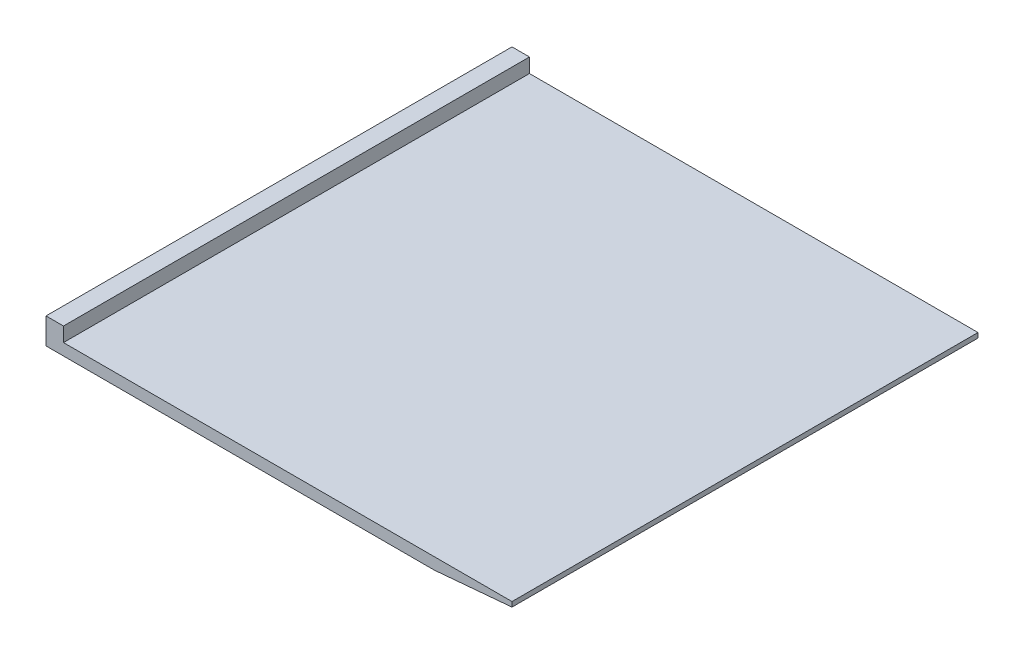
ISO-10303-21;
HEADER;
FILE_DESCRIPTION(('STEP AP214'),'2;1');
FILE_NAME('part.step','',(''),(''),'','','');
FILE_SCHEMA(('AUTOMOTIVE_DESIGN { 1 0 10303 214 1 1 1 1 }'));
ENDSEC;
DATA;
#1=APPLICATION_CONTEXT('core data for automotive mechanical design processes');
#2=APPLICATION_PROTOCOL_DEFINITION('international standard','automotive_design',2000,#1);
#3=PRODUCT_CONTEXT('',#1,'mechanical');
#4=PRODUCT('Part','Part','',(#3));
#5=PRODUCT_RELATED_PRODUCT_CATEGORY('part','',(#4));
#6=PRODUCT_DEFINITION_FORMATION('','',#4);
#7=PRODUCT_DEFINITION_CONTEXT('part definition',#1,'design');
#8=PRODUCT_DEFINITION('design','',#6,#7);
#9=PRODUCT_DEFINITION_SHAPE('','',#8);
#10=(LENGTH_UNIT() NAMED_UNIT(*) SI_UNIT(.MILLI.,.METRE.));
#11=(NAMED_UNIT(*) PLANE_ANGLE_UNIT() SI_UNIT($,.RADIAN.));
#12=(NAMED_UNIT(*) SI_UNIT($,.STERADIAN.) SOLID_ANGLE_UNIT());
#13=UNCERTAINTY_MEASURE_WITH_UNIT(LENGTH_MEASURE(1.E-05),#10,'distance_accuracy_value','');
#14=(GEOMETRIC_REPRESENTATION_CONTEXT(3) GLOBAL_UNCERTAINTY_ASSIGNED_CONTEXT((#13)) GLOBAL_UNIT_ASSIGNED_CONTEXT((#10,
#11,#12)) REPRESENTATION_CONTEXT('',''));
#15=CARTESIAN_POINT('',(0.,0.,0.));
#16=DIRECTION('',(0.,0.,1.));
#17=DIRECTION('',(1.,0.,0.));
#18=AXIS2_PLACEMENT_3D('',#15,#16,#17);
#19=CARTESIAN_POINT('',(0.,1.5,0.));
#20=DIRECTION('',(0.,-1.,0.));
#21=DIRECTION('',(0.,0.,-1.));
#22=AXIS2_PLACEMENT_3D('',#19,#20,#21);
#23=PLANE('',#22);
#24=DIRECTION('',(0.,0.,-1.));
#25=VECTOR('',#24,1.);
#26=CARTESIAN_POINT('',(-27.75,1.5,-30.));
#27=LINE('',#26,#25);
#28=CARTESIAN_POINT('',(-27.75,1.5,30.));
#29=VERTEX_POINT('',#28);
#30=CARTESIAN_POINT('',(-27.75,1.5,-30.));
#31=VERTEX_POINT('',#30);
#32=EDGE_CURVE('E133',#29,#31,#27,.T.);
#33=ORIENTED_EDGE('',*,*,#32,.F.);
#34=DIRECTION('',(1.,0.,0.));
#35=VECTOR('',#34,1.);
#36=CARTESIAN_POINT('',(-30.,1.5,30.));
#37=LINE('',#36,#35);
#38=CARTESIAN_POINT('',(30.,1.5,30.));
#39=VERTEX_POINT('',#38);
#40=EDGE_CURVE('E158',#29,#39,#37,.T.);
#41=ORIENTED_EDGE('',*,*,#40,.T.);
#42=DIRECTION('',(0.,0.,-1.));
#43=VECTOR('',#42,1.);
#44=CARTESIAN_POINT('',(30.,1.5,30.));
#45=LINE('',#44,#43);
#46=CARTESIAN_POINT('',(30.,1.5,-30.));
#47=VERTEX_POINT('',#46);
#48=EDGE_CURVE('E150',#39,#47,#45,.T.);
#49=ORIENTED_EDGE('',*,*,#48,.T.);
#50=DIRECTION('',(-1.,0.,0.));
#51=VECTOR('',#50,1.);
#52=CARTESIAN_POINT('',(-30.,1.5,-30.));
#53=LINE('',#52,#51);
#54=EDGE_CURVE('E154',#47,#31,#53,.T.);
#55=ORIENTED_EDGE('',*,*,#54,.T.);
#56=EDGE_LOOP('',(#33,#41,#49,#55));
#57=FACE_BOUND('',#56,.T.);
#58=ADVANCED_FACE('F44',(#57),#23,.F.);
#59=CARTESIAN_POINT('',(30.,1.5,30.));
#60=DIRECTION('',(-1.,0.,0.));
#61=DIRECTION('',(0.,0.,1.));
#62=AXIS2_PLACEMENT_3D('',#59,#60,#61);
#63=PLANE('',#62);
#64=DIRECTION('',(0.,-1.,0.));
#65=VECTOR('',#64,1.);
#66=CARTESIAN_POINT('',(30.,1.5,30.));
#67=LINE('',#66,#65);
#68=CARTESIAN_POINT('',(30.,0.874886635259243,30.));
#69=VERTEX_POINT('',#68);
#70=EDGE_CURVE('E115',#39,#69,#67,.T.);
#71=ORIENTED_EDGE('',*,*,#70,.T.);
#72=DIRECTION('',(0.,0.,-1.));
#73=VECTOR('',#72,1.);
#74=CARTESIAN_POINT('',(30.,0.874886635259243,-30.));
#75=LINE('',#74,#73);
#76=CARTESIAN_POINT('',(30.,0.874886635259243,-30.));
#77=VERTEX_POINT('',#76);
#78=EDGE_CURVE('E175',#69,#77,#75,.T.);
#79=ORIENTED_EDGE('',*,*,#78,.T.);
#80=DIRECTION('',(0.,-1.,0.));
#81=VECTOR('',#80,1.);
#82=CARTESIAN_POINT('',(30.,1.5,-30.));
#83=LINE('',#82,#81);
#84=EDGE_CURVE('E172',#47,#77,#83,.T.);
#85=ORIENTED_EDGE('',*,*,#84,.F.);
#86=ORIENTED_EDGE('',*,*,#48,.F.);
#87=EDGE_LOOP('',(#71,#79,#85,#86));
#88=FACE_BOUND('',#87,.T.);
#89=ADVANCED_FACE('F184',(#88),#63,.F.);
#90=CARTESIAN_POINT('',(-30.,1.5,-30.));
#91=DIRECTION('',(0.,0.,1.));
#92=DIRECTION('',(1.,0.,0.));
#93=AXIS2_PLACEMENT_3D('',#90,#91,#92);
#94=PLANE('',#93);
#95=ORIENTED_EDGE('',*,*,#84,.T.);
#96=DIRECTION('',(-0.996194698091746,-0.0871557427476549,0.));
#97=VECTOR('',#96,1.);
#98=CARTESIAN_POINT('',(30.,0.874886635259243,-30.));
#99=LINE('',#98,#97);
#100=CARTESIAN_POINT('',(19.9999999999996,0.,-30.));
#101=VERTEX_POINT('',#100);
#102=EDGE_CURVE('E68',#77,#101,#99,.T.);
#103=ORIENTED_EDGE('',*,*,#102,.T.);
#104=DIRECTION('',(-1.,0.,0.));
#105=VECTOR('',#104,1.);
#106=CARTESIAN_POINT('',(-30.,0.,-30.));
#107=LINE('',#106,#105);
#108=CARTESIAN_POINT('',(-30.,0.,-30.));
#109=VERTEX_POINT('',#108);
#110=EDGE_CURVE('E149',#101,#109,#107,.T.);
#111=ORIENTED_EDGE('',*,*,#110,.T.);
#112=DIRECTION('',(0.,-1.,0.));
#113=VECTOR('',#112,1.);
#114=CARTESIAN_POINT('',(-30.,1.5,-30.));
#115=LINE('',#114,#113);
#116=CARTESIAN_POINT('',(-30.,3.35,-30.));
#117=VERTEX_POINT('',#116);
#118=EDGE_CURVE('E114',#117,#109,#115,.T.);
#119=ORIENTED_EDGE('',*,*,#118,.F.);
#120=DIRECTION('',(-1.,0.,0.));
#121=VECTOR('',#120,1.);
#122=CARTESIAN_POINT('',(-30.,3.35,-30.));
#123=LINE('',#122,#121);
#124=CARTESIAN_POINT('',(-27.75,3.35,-30.));
#125=VERTEX_POINT('',#124);
#126=EDGE_CURVE('E131',#125,#117,#123,.T.);
#127=ORIENTED_EDGE('',*,*,#126,.F.);
#128=DIRECTION('',(0.,-1.,0.));
#129=VECTOR('',#128,1.);
#130=CARTESIAN_POINT('',(-27.75,3.35,-30.));
#131=LINE('',#130,#129);
#132=EDGE_CURVE('E142',#125,#31,#131,.T.);
#133=ORIENTED_EDGE('',*,*,#132,.T.);
#134=ORIENTED_EDGE('',*,*,#54,.F.);
#135=EDGE_LOOP('',(#95,#103,#111,#119,#127,#133,#134));
#136=FACE_BOUND('',#135,.T.);
#137=ADVANCED_FACE('F189',(#136),#94,.F.);
#138=CARTESIAN_POINT('',(-30.,1.5,30.));
#139=DIRECTION('',(1.,0.,0.));
#140=DIRECTION('',(0.,0.,-1.));
#141=AXIS2_PLACEMENT_3D('',#138,#139,#140);
#142=PLANE('',#141);
#143=DIRECTION('',(0.,0.,1.));
#144=VECTOR('',#143,1.);
#145=CARTESIAN_POINT('',(-30.,0.,30.));
#146=LINE('',#145,#144);
#147=CARTESIAN_POINT('',(-30.,0.,30.));
#148=VERTEX_POINT('',#147);
#149=EDGE_CURVE('E111',#109,#148,#146,.T.);
#150=ORIENTED_EDGE('',*,*,#149,.T.);
#151=DIRECTION('',(0.,-1.,0.));
#152=VECTOR('',#151,1.);
#153=CARTESIAN_POINT('',(-30.,1.5,30.));
#154=LINE('',#153,#152);
#155=CARTESIAN_POINT('',(-30.,3.35,30.));
#156=VERTEX_POINT('',#155);
#157=EDGE_CURVE('E104',#156,#148,#154,.T.);
#158=ORIENTED_EDGE('',*,*,#157,.F.);
#159=DIRECTION('',(0.,0.,1.));
#160=VECTOR('',#159,1.);
#161=CARTESIAN_POINT('',(-30.,3.35,-30.));
#162=LINE('',#161,#160);
#163=EDGE_CURVE('E109',#117,#156,#162,.T.);
#164=ORIENTED_EDGE('',*,*,#163,.F.);
#165=ORIENTED_EDGE('',*,*,#118,.T.);
#166=EDGE_LOOP('',(#150,#158,#164,#165));
#167=FACE_BOUND('',#166,.T.);
#168=ADVANCED_FACE('F106',(#167),#142,.F.);
#169=CARTESIAN_POINT('',(-30.,1.5,30.));
#170=DIRECTION('',(0.,0.,-1.));
#171=DIRECTION('',(-1.,0.,0.));
#172=AXIS2_PLACEMENT_3D('',#169,#170,#171);
#173=PLANE('',#172);
#174=DIRECTION('',(1.,0.,0.));
#175=VECTOR('',#174,1.);
#176=CARTESIAN_POINT('',(-30.,0.,30.));
#177=LINE('',#176,#175);
#178=CARTESIAN_POINT('',(19.9999999999996,0.,30.));
#179=VERTEX_POINT('',#178);
#180=EDGE_CURVE('E155',#148,#179,#177,.T.);
#181=ORIENTED_EDGE('',*,*,#180,.T.);
#182=DIRECTION('',(0.996194698091746,0.0871557427476549,0.));
#183=VECTOR('',#182,1.);
#184=CARTESIAN_POINT('',(30.,0.874886635259243,30.));
#185=LINE('',#184,#183);
#186=EDGE_CURVE('E11',#179,#69,#185,.T.);
#187=ORIENTED_EDGE('',*,*,#186,.T.);
#188=ORIENTED_EDGE('',*,*,#70,.F.);
#189=ORIENTED_EDGE('',*,*,#40,.F.);
#190=DIRECTION('',(0.,-1.,0.));
#191=VECTOR('',#190,1.);
#192=CARTESIAN_POINT('',(-27.75,3.35,30.));
#193=LINE('',#192,#191);
#194=CARTESIAN_POINT('',(-27.75,3.35,30.));
#195=VERTEX_POINT('',#194);
#196=EDGE_CURVE('E122',#195,#29,#193,.T.);
#197=ORIENTED_EDGE('',*,*,#196,.F.);
#198=DIRECTION('',(1.,0.,0.));
#199=VECTOR('',#198,1.);
#200=CARTESIAN_POINT('',(-30.,3.35,30.));
#201=LINE('',#200,#199);
#202=EDGE_CURVE('E118',#156,#195,#201,.T.);
#203=ORIENTED_EDGE('',*,*,#202,.F.);
#204=ORIENTED_EDGE('',*,*,#157,.T.);
#205=EDGE_LOOP('',(#181,#187,#188,#189,#197,#203,#204));
#206=FACE_BOUND('',#205,.T.);
#207=ADVANCED_FACE('F119',(#206),#173,.F.);
#208=CARTESIAN_POINT('',(0.,0.,0.));
#209=DIRECTION('',(0.,-1.,0.));
#210=DIRECTION('',(0.,0.,-1.));
#211=AXIS2_PLACEMENT_3D('',#208,#209,#210);
#212=PLANE('',#211);
#213=ORIENTED_EDGE('',*,*,#110,.F.);
#214=DIRECTION('',(0.,0.,1.));
#215=VECTOR('',#214,1.);
#216=CARTESIAN_POINT('',(19.9999999999996,0.,30.));
#217=LINE('',#216,#215);
#218=EDGE_CURVE('E54',#101,#179,#217,.T.);
#219=ORIENTED_EDGE('',*,*,#218,.T.);
#220=ORIENTED_EDGE('',*,*,#180,.F.);
#221=ORIENTED_EDGE('',*,*,#149,.F.);
#222=EDGE_LOOP('',(#213,#219,#220,#221));
#223=FACE_BOUND('',#222,.T.);
#224=ADVANCED_FACE('F206',(#223),#212,.T.);
#225=CARTESIAN_POINT('',(-27.75,3.35,-30.));
#226=DIRECTION('',(-1.,0.,0.));
#227=DIRECTION('',(0.,0.,1.));
#228=AXIS2_PLACEMENT_3D('',#225,#226,#227);
#229=PLANE('',#228);
#230=ORIENTED_EDGE('',*,*,#32,.T.);
#231=ORIENTED_EDGE('',*,*,#132,.F.);
#232=DIRECTION('',(0.,0.,-1.));
#233=VECTOR('',#232,1.);
#234=CARTESIAN_POINT('',(-27.75,3.35,-30.));
#235=LINE('',#234,#233);
#236=EDGE_CURVE('E126',#195,#125,#235,.T.);
#237=ORIENTED_EDGE('',*,*,#236,.F.);
#238=ORIENTED_EDGE('',*,*,#196,.T.);
#239=EDGE_LOOP('',(#230,#231,#237,#238));
#240=FACE_BOUND('',#239,.T.);
#241=ADVANCED_FACE('F196',(#240),#229,.F.);
#242=CARTESIAN_POINT('',(0.,3.35,0.));
#243=DIRECTION('',(0.,1.,0.));
#244=DIRECTION('',(0.,0.,1.));
#245=AXIS2_PLACEMENT_3D('',#242,#243,#244);
#246=PLANE('',#245);
#247=ORIENTED_EDGE('',*,*,#163,.T.);
#248=ORIENTED_EDGE('',*,*,#202,.T.);
#249=ORIENTED_EDGE('',*,*,#236,.T.);
#250=ORIENTED_EDGE('',*,*,#126,.T.);
#251=EDGE_LOOP('',(#247,#248,#249,#250));
#252=FACE_BOUND('',#251,.T.);
#253=ADVANCED_FACE('F129',(#252),#246,.T.);
#254=CARTESIAN_POINT('',(30.,0.874886635259243,30.));
#255=DIRECTION('',(0.0871557427476549,-0.996194698091746,0.));
#256=DIRECTION('',(0.,0.,1.));
#257=AXIS2_PLACEMENT_3D('',#254,#255,#256);
#258=PLANE('',#257);
#259=ORIENTED_EDGE('',*,*,#186,.F.);
#260=ORIENTED_EDGE('',*,*,#218,.F.);
#261=ORIENTED_EDGE('',*,*,#102,.F.);
#262=ORIENTED_EDGE('',*,*,#78,.F.);
#263=EDGE_LOOP('',(#259,#260,#261,#262));
#264=FACE_BOUND('',#263,.T.);
#265=ADVANCED_FACE('F47',(#264),#258,.T.);
#266=CLOSED_SHELL('',(#58,#89,#137,#168,#207,#224,#241,#253,#265));
#267=MANIFOLD_SOLID_BREP('B2',#266);
#268=ADVANCED_BREP_SHAPE_REPRESENTATION('',(#18,#267),#14);
#269=SHAPE_DEFINITION_REPRESENTATION(#9,#268);
ENDSEC;
END-ISO-10303-21;
